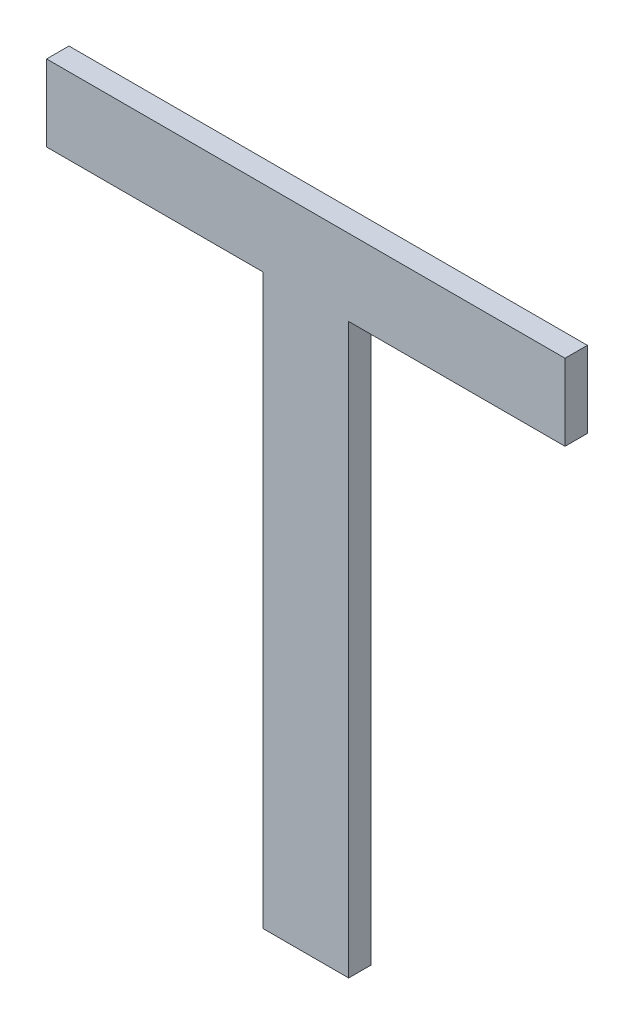
ISO-10303-21;
HEADER;
FILE_DESCRIPTION(('STEP AP214'),'2;1');
FILE_NAME('part.step','',(''),(''),'','','');
FILE_SCHEMA(('AUTOMOTIVE_DESIGN { 1 0 10303 214 1 1 1 1 }'));
ENDSEC;
DATA;
#1=APPLICATION_CONTEXT('core data for automotive mechanical design processes');
#2=APPLICATION_PROTOCOL_DEFINITION('international standard','automotive_design',2000,#1);
#3=PRODUCT_CONTEXT('',#1,'mechanical');
#4=PRODUCT('Part','Part','',(#3));
#5=PRODUCT_RELATED_PRODUCT_CATEGORY('part','',(#4));
#6=PRODUCT_DEFINITION_FORMATION('','',#4);
#7=PRODUCT_DEFINITION_CONTEXT('part definition',#1,'design');
#8=PRODUCT_DEFINITION('design','',#6,#7);
#9=PRODUCT_DEFINITION_SHAPE('','',#8);
#10=(LENGTH_UNIT() NAMED_UNIT(*) SI_UNIT(.MILLI.,.METRE.));
#11=(NAMED_UNIT(*) PLANE_ANGLE_UNIT() SI_UNIT($,.RADIAN.));
#12=(NAMED_UNIT(*) SI_UNIT($,.STERADIAN.) SOLID_ANGLE_UNIT());
#13=UNCERTAINTY_MEASURE_WITH_UNIT(LENGTH_MEASURE(1.E-05),#10,'distance_accuracy_value','');
#14=(GEOMETRIC_REPRESENTATION_CONTEXT(3) GLOBAL_UNCERTAINTY_ASSIGNED_CONTEXT((#13)) GLOBAL_UNIT_ASSIGNED_CONTEXT((#10,
#11,#12)) REPRESENTATION_CONTEXT('',''));
#15=CARTESIAN_POINT('',(0.,0.,0.));
#16=DIRECTION('',(0.,0.,1.));
#17=DIRECTION('',(1.,0.,0.));
#18=AXIS2_PLACEMENT_3D('',#15,#16,#17);
#19=CARTESIAN_POINT('',(-1.37883091452185,-1.29151572108378,0.0042));
#20=DIRECTION('',(0.,0.,1.));
#21=DIRECTION('',(1.,0.,0.));
#22=AXIS2_PLACEMENT_3D('',#19,#20,#21);
#23=PLANE('',#22);
#24=DIRECTION('',(0.,-1.,0.));
#25=VECTOR('',#24,1.);
#26=CARTESIAN_POINT('',(-1.39185522536437,-1.24884528398684,0.0042));
#27=LINE('',#26,#25);
#28=CARTESIAN_POINT('',(-1.39185522536437,-1.24884528398684,0.0042));
#29=VERTEX_POINT('',#28);
#30=CARTESIAN_POINT('',(-1.39185522536437,-1.4216556522388,0.0042));
#31=VERTEX_POINT('',#30);
#32=EDGE_CURVE('E11',#29,#31,#27,.T.);
#33=ORIENTED_EDGE('',*,*,#32,.T.);
#34=DIRECTION('',(1.,0.,0.));
#35=VECTOR('',#34,1.);
#36=CARTESIAN_POINT('',(-1.39185522536437,-1.4216556522388,0.0042));
#37=LINE('',#36,#35);
#38=CARTESIAN_POINT('',(-1.36580660367933,-1.4216556522388,0.0042));
#39=VERTEX_POINT('',#38);
#40=EDGE_CURVE('E95',#31,#39,#37,.T.);
#41=ORIENTED_EDGE('',*,*,#40,.T.);
#42=DIRECTION('',(0.,1.,0.));
#43=VECTOR('',#42,1.);
#44=CARTESIAN_POINT('',(-1.36580660367933,-1.4216556522388,0.0042));
#45=LINE('',#44,#43);
#46=CARTESIAN_POINT('',(-1.36580660367933,-1.24884528398684,0.0042));
#47=VERTEX_POINT('',#46);
#48=EDGE_CURVE('E136',#39,#47,#45,.T.);
#49=ORIENTED_EDGE('',*,*,#48,.T.);
#50=DIRECTION('',(1.,0.,0.));
#51=VECTOR('',#50,1.);
#52=CARTESIAN_POINT('',(-1.36580660367933,-1.24884528398684,0.0042));
#53=LINE('',#52,#51);
#54=CARTESIAN_POINT('',(-1.30004971723052,-1.24884528398684,0.0042));
#55=VERTEX_POINT('',#54);
#56=EDGE_CURVE('E127',#47,#55,#53,.T.);
#57=ORIENTED_EDGE('',*,*,#56,.T.);
#58=DIRECTION('',(0.,1.,0.));
#59=VECTOR('',#58,1.);
#60=CARTESIAN_POINT('',(-1.30004971723052,-1.24884528398684,0.0042));
#61=LINE('',#60,#59);
#62=CARTESIAN_POINT('',(-1.30004971723052,-1.2256556573648,0.0042));
#63=VERTEX_POINT('',#62);
#64=EDGE_CURVE('E117',#55,#63,#61,.T.);
#65=ORIENTED_EDGE('',*,*,#64,.T.);
#66=DIRECTION('',(-1.,0.,0.));
#67=VECTOR('',#66,1.);
#68=CARTESIAN_POINT('',(-1.30004971723052,-1.2256556573648,0.0042));
#69=LINE('',#68,#67);
#70=CARTESIAN_POINT('',(-1.45761211181318,-1.2256556573648,0.0042));
#71=VERTEX_POINT('',#70);
#72=EDGE_CURVE('E109',#63,#71,#69,.T.);
#73=ORIENTED_EDGE('',*,*,#72,.T.);
#74=DIRECTION('',(0.,-1.,0.));
#75=VECTOR('',#74,1.);
#76=CARTESIAN_POINT('',(-1.45761211181318,-1.2256556573648,0.0042));
#77=LINE('',#76,#75);
#78=CARTESIAN_POINT('',(-1.45761211181318,-1.24884528398684,0.0042));
#79=VERTEX_POINT('',#78);
#80=EDGE_CURVE('E119',#71,#79,#77,.T.);
#81=ORIENTED_EDGE('',*,*,#80,.T.);
#82=DIRECTION('',(1.,0.,0.));
#83=VECTOR('',#82,1.);
#84=CARTESIAN_POINT('',(-1.45761211181318,-1.24884528398684,0.0042));
#85=LINE('',#84,#83);
#86=EDGE_CURVE('E129',#79,#29,#85,.T.);
#87=ORIENTED_EDGE('',*,*,#86,.T.);
#88=EDGE_LOOP('',(#33,#41,#49,#57,#65,#73,#81,#87));
#89=FACE_BOUND('',#88,.T.);
#90=ADVANCED_FACE('F17',(#89),#23,.T.);
#91=CARTESIAN_POINT('',(-1.45761211181318,-1.24884528398684,-0.0026));
#92=DIRECTION('',(0.,-1.,0.));
#93=DIRECTION('',(1.,0.,0.));
#94=AXIS2_PLACEMENT_3D('',#91,#92,#93);
#95=PLANE('',#94);
#96=DIRECTION('',(-1.,0.,0.));
#97=VECTOR('',#96,1.);
#98=CARTESIAN_POINT('',(-1.39185522536437,-1.24884528398684,-0.0026));
#99=LINE('',#98,#97);
#100=CARTESIAN_POINT('',(-1.39185522536437,-1.24884528398684,-0.0026));
#101=VERTEX_POINT('',#100);
#102=CARTESIAN_POINT('',(-1.45761211181318,-1.24884528398684,-0.0026));
#103=VERTEX_POINT('',#102);
#104=EDGE_CURVE('E24',#101,#103,#99,.T.);
#105=ORIENTED_EDGE('',*,*,#104,.F.);
#106=DIRECTION('',(0.,0.,1.));
#107=VECTOR('',#106,1.);
#108=CARTESIAN_POINT('',(-1.39185522536437,-1.24884528398684,-0.0026));
#109=LINE('',#108,#107);
#110=EDGE_CURVE('E84',#101,#29,#109,.T.);
#111=ORIENTED_EDGE('',*,*,#110,.T.);
#112=ORIENTED_EDGE('',*,*,#86,.F.);
#113=DIRECTION('',(0.,0.,1.));
#114=VECTOR('',#113,1.);
#115=CARTESIAN_POINT('',(-1.45761211181318,-1.24884528398684,-0.0026));
#116=LINE('',#115,#114);
#117=EDGE_CURVE('E131',#103,#79,#116,.T.);
#118=ORIENTED_EDGE('',*,*,#117,.F.);
#119=EDGE_LOOP('',(#105,#111,#112,#118));
#120=FACE_BOUND('',#119,.T.);
#121=ADVANCED_FACE('F147',(#120),#95,.T.);
#122=CARTESIAN_POINT('',(-1.45761211181318,-1.2256556573648,-0.0026));
#123=DIRECTION('',(-1.,0.,0.));
#124=DIRECTION('',(0.,-1.,0.));
#125=AXIS2_PLACEMENT_3D('',#122,#123,#124);
#126=PLANE('',#125);
#127=DIRECTION('',(0.,1.,0.));
#128=VECTOR('',#127,1.);
#129=CARTESIAN_POINT('',(-1.45761211181318,-1.24884528398684,-0.0026));
#130=LINE('',#129,#128);
#131=CARTESIAN_POINT('',(-1.45761211181318,-1.2256556573648,-0.0026));
#132=VERTEX_POINT('',#131);
#133=EDGE_CURVE('E139',#103,#132,#130,.T.);
#134=ORIENTED_EDGE('',*,*,#133,.F.);
#135=ORIENTED_EDGE('',*,*,#117,.T.);
#136=ORIENTED_EDGE('',*,*,#80,.F.);
#137=DIRECTION('',(0.,0.,1.));
#138=VECTOR('',#137,1.);
#139=CARTESIAN_POINT('',(-1.45761211181318,-1.2256556573648,-0.0026));
#140=LINE('',#139,#138);
#141=EDGE_CURVE('E122',#132,#71,#140,.T.);
#142=ORIENTED_EDGE('',*,*,#141,.F.);
#143=EDGE_LOOP('',(#134,#135,#136,#142));
#144=FACE_BOUND('',#143,.T.);
#145=ADVANCED_FACE('F144',(#144),#126,.T.);
#146=CARTESIAN_POINT('',(-1.30004971723052,-1.2256556573648,-0.0026));
#147=DIRECTION('',(0.,1.,0.));
#148=DIRECTION('',(-1.,0.,0.));
#149=AXIS2_PLACEMENT_3D('',#146,#147,#148);
#150=PLANE('',#149);
#151=DIRECTION('',(1.,0.,0.));
#152=VECTOR('',#151,1.);
#153=CARTESIAN_POINT('',(-1.45761211181318,-1.2256556573648,-0.0026));
#154=LINE('',#153,#152);
#155=CARTESIAN_POINT('',(-1.30004971723052,-1.2256556573648,-0.0026));
#156=VERTEX_POINT('',#155);
#157=EDGE_CURVE('E133',#132,#156,#154,.T.);
#158=ORIENTED_EDGE('',*,*,#157,.F.);
#159=ORIENTED_EDGE('',*,*,#141,.T.);
#160=ORIENTED_EDGE('',*,*,#72,.F.);
#161=DIRECTION('',(0.,0.,1.));
#162=VECTOR('',#161,1.);
#163=CARTESIAN_POINT('',(-1.30004971723052,-1.2256556573648,-0.0026));
#164=LINE('',#163,#162);
#165=EDGE_CURVE('E112',#156,#63,#164,.T.);
#166=ORIENTED_EDGE('',*,*,#165,.F.);
#167=EDGE_LOOP('',(#158,#159,#160,#166));
#168=FACE_BOUND('',#167,.T.);
#169=ADVANCED_FACE('F152',(#168),#150,.T.);
#170=CARTESIAN_POINT('',(-1.30004971723052,-1.24884528398684,-0.0026));
#171=DIRECTION('',(1.,0.,0.));
#172=DIRECTION('',(0.,1.,0.));
#173=AXIS2_PLACEMENT_3D('',#170,#171,#172);
#174=PLANE('',#173);
#175=DIRECTION('',(0.,-1.,0.));
#176=VECTOR('',#175,1.);
#177=CARTESIAN_POINT('',(-1.30004971723052,-1.2256556573648,-0.0026));
#178=LINE('',#177,#176);
#179=CARTESIAN_POINT('',(-1.30004971723052,-1.24884528398684,-0.0026));
#180=VERTEX_POINT('',#179);
#181=EDGE_CURVE('E124',#156,#180,#178,.T.);
#182=ORIENTED_EDGE('',*,*,#181,.F.);
#183=ORIENTED_EDGE('',*,*,#165,.T.);
#184=ORIENTED_EDGE('',*,*,#64,.F.);
#185=DIRECTION('',(0.,0.,1.));
#186=VECTOR('',#185,1.);
#187=CARTESIAN_POINT('',(-1.30004971723052,-1.24884528398684,-0.0026));
#188=LINE('',#187,#186);
#189=EDGE_CURVE('E101',#180,#55,#188,.T.);
#190=ORIENTED_EDGE('',*,*,#189,.F.);
#191=EDGE_LOOP('',(#182,#183,#184,#190));
#192=FACE_BOUND('',#191,.T.);
#193=ADVANCED_FACE('F154',(#192),#174,.T.);
#194=CARTESIAN_POINT('',(-1.36580660367933,-1.24884528398684,-0.0026));
#195=DIRECTION('',(0.,-1.,0.));
#196=DIRECTION('',(1.,0.,0.));
#197=AXIS2_PLACEMENT_3D('',#194,#195,#196);
#198=PLANE('',#197);
#199=DIRECTION('',(-1.,0.,0.));
#200=VECTOR('',#199,1.);
#201=CARTESIAN_POINT('',(-1.30004971723052,-1.24884528398684,-0.0026));
#202=LINE('',#201,#200);
#203=CARTESIAN_POINT('',(-1.36580660367933,-1.24884528398684,-0.0026));
#204=VERTEX_POINT('',#203);
#205=EDGE_CURVE('E115',#180,#204,#202,.T.);
#206=ORIENTED_EDGE('',*,*,#205,.F.);
#207=ORIENTED_EDGE('',*,*,#189,.T.);
#208=ORIENTED_EDGE('',*,*,#56,.F.);
#209=DIRECTION('',(0.,0.,1.));
#210=VECTOR('',#209,1.);
#211=CARTESIAN_POINT('',(-1.36580660367933,-1.24884528398684,-0.0026));
#212=LINE('',#211,#210);
#213=EDGE_CURVE('E87',#204,#47,#212,.T.);
#214=ORIENTED_EDGE('',*,*,#213,.F.);
#215=EDGE_LOOP('',(#206,#207,#208,#214));
#216=FACE_BOUND('',#215,.T.);
#217=ADVANCED_FACE('F158',(#216),#198,.T.);
#218=CARTESIAN_POINT('',(-1.36580660367933,-1.4216556522388,-0.0026));
#219=DIRECTION('',(1.,0.,0.));
#220=DIRECTION('',(0.,1.,0.));
#221=AXIS2_PLACEMENT_3D('',#218,#219,#220);
#222=PLANE('',#221);
#223=DIRECTION('',(0.,-1.,0.));
#224=VECTOR('',#223,1.);
#225=CARTESIAN_POINT('',(-1.36580660367933,-1.24884528398684,-0.0026));
#226=LINE('',#225,#224);
#227=CARTESIAN_POINT('',(-1.36580660367933,-1.4216556522388,-0.0026));
#228=VERTEX_POINT('',#227);
#229=EDGE_CURVE('E100',#204,#228,#226,.T.);
#230=ORIENTED_EDGE('',*,*,#229,.F.);
#231=ORIENTED_EDGE('',*,*,#213,.T.);
#232=ORIENTED_EDGE('',*,*,#48,.F.);
#233=DIRECTION('',(0.,0.,1.));
#234=VECTOR('',#233,1.);
#235=CARTESIAN_POINT('',(-1.36580660367933,-1.4216556522388,-0.0026));
#236=LINE('',#235,#234);
#237=EDGE_CURVE('E88',#228,#39,#236,.T.);
#238=ORIENTED_EDGE('',*,*,#237,.F.);
#239=EDGE_LOOP('',(#230,#231,#232,#238));
#240=FACE_BOUND('',#239,.T.);
#241=ADVANCED_FACE('F162',(#240),#222,.T.);
#242=CARTESIAN_POINT('',(-1.39185522536437,-1.4216556522388,-0.0026));
#243=DIRECTION('',(0.,-1.,0.));
#244=DIRECTION('',(1.,0.,0.));
#245=AXIS2_PLACEMENT_3D('',#242,#243,#244);
#246=PLANE('',#245);
#247=DIRECTION('',(-1.,0.,0.));
#248=VECTOR('',#247,1.);
#249=CARTESIAN_POINT('',(-1.36580660367933,-1.4216556522388,-0.0026));
#250=LINE('',#249,#248);
#251=CARTESIAN_POINT('',(-1.39185522536437,-1.4216556522388,-0.0026));
#252=VERTEX_POINT('',#251);
#253=EDGE_CURVE('E93',#228,#252,#250,.T.);
#254=ORIENTED_EDGE('',*,*,#253,.F.);
#255=ORIENTED_EDGE('',*,*,#237,.T.);
#256=ORIENTED_EDGE('',*,*,#40,.F.);
#257=DIRECTION('',(0.,0.,1.));
#258=VECTOR('',#257,1.);
#259=CARTESIAN_POINT('',(-1.39185522536437,-1.4216556522388,-0.0026));
#260=LINE('',#259,#258);
#261=EDGE_CURVE('E82',#252,#31,#260,.T.);
#262=ORIENTED_EDGE('',*,*,#261,.F.);
#263=EDGE_LOOP('',(#254,#255,#256,#262));
#264=FACE_BOUND('',#263,.T.);
#265=ADVANCED_FACE('F91',(#264),#246,.T.);
#266=CARTESIAN_POINT('',(-1.39185522536437,-1.24884528398684,-0.0026));
#267=DIRECTION('',(-1.,0.,0.));
#268=DIRECTION('',(0.,-1.,0.));
#269=AXIS2_PLACEMENT_3D('',#266,#267,#268);
#270=PLANE('',#269);
#271=DIRECTION('',(0.,1.,0.));
#272=VECTOR('',#271,1.);
#273=CARTESIAN_POINT('',(-1.39185522536437,-1.4216556522388,-0.0026));
#274=LINE('',#273,#272);
#275=EDGE_CURVE('E79',#252,#101,#274,.T.);
#276=ORIENTED_EDGE('',*,*,#275,.F.);
#277=ORIENTED_EDGE('',*,*,#261,.T.);
#278=ORIENTED_EDGE('',*,*,#32,.F.);
#279=ORIENTED_EDGE('',*,*,#110,.F.);
#280=EDGE_LOOP('',(#276,#277,#278,#279));
#281=FACE_BOUND('',#280,.T.);
#282=ADVANCED_FACE('F81',(#281),#270,.T.);
#283=CARTESIAN_POINT('',(-1.37883091452185,-1.29151572108378,-0.0026));
#284=DIRECTION('',(0.,0.,1.));
#285=DIRECTION('',(1.,0.,0.));
#286=AXIS2_PLACEMENT_3D('',#283,#284,#285);
#287=PLANE('',#286);
#288=ORIENTED_EDGE('',*,*,#275,.T.);
#289=ORIENTED_EDGE('',*,*,#104,.T.);
#290=ORIENTED_EDGE('',*,*,#133,.T.);
#291=ORIENTED_EDGE('',*,*,#157,.T.);
#292=ORIENTED_EDGE('',*,*,#181,.T.);
#293=ORIENTED_EDGE('',*,*,#205,.T.);
#294=ORIENTED_EDGE('',*,*,#229,.T.);
#295=ORIENTED_EDGE('',*,*,#253,.T.);
#296=EDGE_LOOP('',(#288,#289,#290,#291,#292,#293,#294,#295));
#297=FACE_BOUND('',#296,.T.);
#298=ADVANCED_FACE('F98',(#297),#287,.F.);
#299=CLOSED_SHELL('',(#90,#121,#145,#169,#193,#217,#241,#265,#282,#298));
#300=MANIFOLD_SOLID_BREP('B1',#299);
#301=ADVANCED_BREP_SHAPE_REPRESENTATION('',(#18,#300),#14);
#302=SHAPE_DEFINITION_REPRESENTATION(#9,#301);
ENDSEC;
END-ISO-10303-21;
